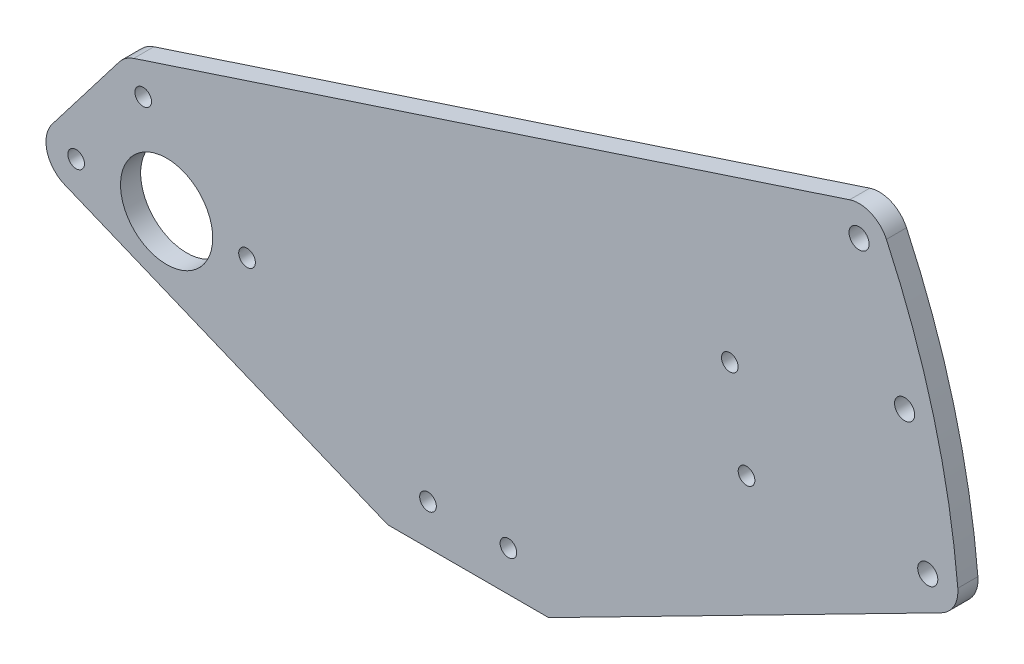
ISO-10303-21;
HEADER;
FILE_DESCRIPTION(('STEP AP214'),'2;1');
FILE_NAME('part.step','',(''),(''),'','','');
FILE_SCHEMA(('AUTOMOTIVE_DESIGN { 1 0 10303 214 1 1 1 1 }'));
ENDSEC;
DATA;
#1=APPLICATION_CONTEXT('core data for automotive mechanical design processes');
#2=APPLICATION_PROTOCOL_DEFINITION('international standard','automotive_design',2000,#1);
#3=PRODUCT_CONTEXT('',#1,'mechanical');
#4=PRODUCT('Part','Part','',(#3));
#5=PRODUCT_RELATED_PRODUCT_CATEGORY('part','',(#4));
#6=PRODUCT_DEFINITION_FORMATION('','',#4);
#7=PRODUCT_DEFINITION_CONTEXT('part definition',#1,'design');
#8=PRODUCT_DEFINITION('design','',#6,#7);
#9=PRODUCT_DEFINITION_SHAPE('','',#8);
#10=(LENGTH_UNIT() NAMED_UNIT(*) SI_UNIT(.MILLI.,.METRE.));
#11=(NAMED_UNIT(*) PLANE_ANGLE_UNIT() SI_UNIT($,.RADIAN.));
#12=(NAMED_UNIT(*) SI_UNIT($,.STERADIAN.) SOLID_ANGLE_UNIT());
#13=UNCERTAINTY_MEASURE_WITH_UNIT(LENGTH_MEASURE(1.E-05),#10,'distance_accuracy_value','');
#14=(GEOMETRIC_REPRESENTATION_CONTEXT(3) GLOBAL_UNCERTAINTY_ASSIGNED_CONTEXT((#13)) GLOBAL_UNIT_ASSIGNED_CONTEXT((#10,
#11,#12)) REPRESENTATION_CONTEXT('',''));
#15=CARTESIAN_POINT('',(0.,0.,0.));
#16=DIRECTION('',(0.,0.,1.));
#17=DIRECTION('',(1.,0.,0.));
#18=AXIS2_PLACEMENT_3D('',#15,#16,#17);
#19=CARTESIAN_POINT('',(-28.575,0.,6.35));
#20=DIRECTION('',(0.,0.,-1.));
#21=DIRECTION('',(-1.,0.,0.));
#22=AXIS2_PLACEMENT_3D('',#19,#20,#21);
#23=PLANE('',#22);
#24=CARTESIAN_POINT('',(-28.575,0.,6.35));
#25=DIRECTION('',(0.,0.,1.));
#26=DIRECTION('',(-1.,0.,0.));
#27=AXIS2_PLACEMENT_3D('',#24,#25,#26);
#28=CIRCLE('',#27,9.525);
#29=CARTESIAN_POINT('',(-36.131690566274,5.79845261130807,6.35));
#30=VERTEX_POINT('',#29);
#31=CARTESIAN_POINT('',(-32.1995145978968,-8.80843453342496,6.35));
#32=VERTEX_POINT('',#31);
#33=EDGE_CURVE('E182',#30,#32,#28,.T.);
#34=ORIENTED_EDGE('',*,*,#33,.T.);
#35=DIRECTION('',(0.924770029755901,-0.380526466970788,0.));
#36=VECTOR('',#35,1.);
#37=CARTESIAN_POINT('',(-32.1995145978968,-8.80843453342496,6.35));
#38=LINE('',#37,#36);
#39=CARTESIAN_POINT('',(69.85,-50.8,6.35));
#40=VERTEX_POINT('',#39);
#41=EDGE_CURVE('E106',#32,#40,#38,.T.);
#42=ORIENTED_EDGE('',*,*,#41,.T.);
#43=DIRECTION('',(1.,0.,0.));
#44=VECTOR('',#43,1.);
#45=CARTESIAN_POINT('',(69.85,-50.8,6.35));
#46=LINE('',#45,#44);
#47=CARTESIAN_POINT('',(120.65,-50.8,6.35));
#48=VERTEX_POINT('',#47);
#49=EDGE_CURVE('E211',#40,#48,#46,.T.);
#50=ORIENTED_EDGE('',*,*,#49,.T.);
#51=DIRECTION('',(0.890616679115882,0.454754803031918,0.));
#52=VECTOR('',#51,1.);
#53=CARTESIAN_POINT('',(120.65,-50.8,6.35));
#54=LINE('',#53,#52);
#55=CARTESIAN_POINT('',(244.713320148417,12.5475568564312,6.35));
#56=VERTEX_POINT('',#55);
#57=EDGE_CURVE('E231',#48,#56,#54,.T.);
#58=ORIENTED_EDGE('',*,*,#57,.T.);
#59=CARTESIAN_POINT('',(240.381780649538,21.03068072501,6.35));
#60=DIRECTION('',(0.,0.,1.));
#61=DIRECTION('',(-1.,0.,0.));
#62=AXIS2_PLACEMENT_3D('',#59,#60,#61);
#63=CIRCLE('',#62,9.52500000000004);
#64=CARTESIAN_POINT('',(249.870535148862,21.8608391746814,6.35));
#65=VERTEX_POINT('',#64);
#66=EDGE_CURVE('E227',#56,#65,#63,.T.);
#67=ORIENTED_EDGE('',*,*,#66,.T.);
#68=CARTESIAN_POINT('',(0.,0.,6.35));
#69=DIRECTION('',(0.,0.,1.));
#70=DIRECTION('',(-1.,0.,0.));
#71=AXIS2_PLACEMENT_3D('',#68,#69,#70);
#72=CIRCLE('',#71,250.825);
#73=CARTESIAN_POINT('',(227.324650683468,106.00322550111,6.35));
#74=VERTEX_POINT('',#73);
#75=EDGE_CURVE('E230',#65,#74,#72,.T.);
#76=ORIENTED_EDGE('',*,*,#75,.T.);
#77=CARTESIAN_POINT('',(218.692069011944,101.97778655803,6.35));
#78=DIRECTION('',(0.,0.,1.));
#79=DIRECTION('',(1.,0.,0.));
#80=AXIS2_PLACEMENT_3D('',#77,#78,#79);
#81=CIRCLE('',#80,9.52499999999996);
#82=CARTESIAN_POINT('',(215.715541799427,111.025764826856,6.35));
#83=VERTEX_POINT('',#82);
#84=EDGE_CURVE('E131',#74,#83,#81,.T.);
#85=ORIENTED_EDGE('',*,*,#84,.T.);
#86=DIRECTION('',(-0.949918978354434,-0.31249629527735,0.));
#87=VECTOR('',#86,1.);
#88=CARTESIAN_POINT('',(-10.3722814263212,36.6493087550361,6.35));
#89=LINE('',#88,#87);
#90=CARTESIAN_POINT('',(-10.3722814263212,36.6493087550361,6.35));
#91=VERTEX_POINT('',#90);
#92=EDGE_CURVE('E125',#83,#91,#89,.T.);
#93=ORIENTED_EDGE('',*,*,#92,.T.);
#94=CARTESIAN_POINT('',(-7.39575421380445,27.6013304862101,6.35));
#95=DIRECTION('',(0.,0.,1.));
#96=DIRECTION('',(1.,0.,0.));
#97=AXIS2_PLACEMENT_3D('',#94,#95,#96);
#98=CIRCLE('',#97,9.525);
#99=CARTESIAN_POINT('',(-14.9524447800785,33.3997830975182,6.35));
#100=VERTEX_POINT('',#99);
#101=EDGE_CURVE('E129',#91,#100,#98,.T.);
#102=ORIENTED_EDGE('',*,*,#101,.T.);
#103=DIRECTION('',(-0.608761429008722,-0.793353340291234,0.));
#104=VECTOR('',#103,1.);
#105=CARTESIAN_POINT('',(-36.131690566274,5.79845261130807,6.35));
#106=LINE('',#105,#104);
#107=EDGE_CURVE('E57',#100,#30,#106,.T.);
#108=ORIENTED_EDGE('',*,*,#107,.T.);
#109=EDGE_LOOP('',(#34,#42,#50,#58,#67,#76,#85,#93,#102,#108));
#110=FACE_BOUND('',#109,.T.);
#111=CARTESIAN_POINT('',(0.,0.,6.35));
#112=DIRECTION('',(0.,0.,1.));
#113=DIRECTION('',(1.,0.,0.));
#114=AXIS2_PLACEMENT_3D('',#111,#112,#113);
#115=CIRCLE('',#114,14.5542);
#116=CARTESIAN_POINT('',(14.5542,0.,6.35));
#117=VERTEX_POINT('',#116);
#118=EDGE_CURVE('E158',#117,#117,#115,.T.);
#119=ORIENTED_EDGE('',*,*,#118,.F.);
#120=EDGE_LOOP('',(#119));
#121=FACE_BOUND('',#120,.T.);
#122=CARTESIAN_POINT('',(-28.575,0.,6.35));
#123=DIRECTION('',(0.,0.,1.));
#124=DIRECTION('',(1.,0.,0.));
#125=AXIS2_PLACEMENT_3D('',#122,#123,#124);
#126=CIRCLE('',#125,2.6289);
#127=CARTESIAN_POINT('',(-25.9461,0.,6.35));
#128=VERTEX_POINT('',#127);
#129=EDGE_CURVE('E249',#128,#128,#126,.T.);
#130=ORIENTED_EDGE('',*,*,#129,.F.);
#131=EDGE_LOOP('',(#130));
#132=FACE_BOUND('',#131,.T.);
#133=CARTESIAN_POINT('',(-7.39575421380445,27.6013304862101,6.35));
#134=DIRECTION('',(0.,0.,1.));
#135=DIRECTION('',(1.,0.,0.));
#136=AXIS2_PLACEMENT_3D('',#133,#134,#135);
#137=CIRCLE('',#136,2.6289);
#138=CARTESIAN_POINT('',(-4.76685421380445,27.6013304862101,6.35));
#139=VERTEX_POINT('',#138);
#140=EDGE_CURVE('E257',#139,#139,#137,.T.);
#141=ORIENTED_EDGE('',*,*,#140,.F.);
#142=EDGE_LOOP('',(#141));
#143=FACE_BOUND('',#142,.T.);
#144=CARTESIAN_POINT('',(240.381780649538,21.03068072501,6.35));
#145=DIRECTION('',(0.,0.,1.));
#146=DIRECTION('',(1.,0.,0.));
#147=AXIS2_PLACEMENT_3D('',#144,#145,#146);
#148=CIRCLE('',#147,3.175);
#149=CARTESIAN_POINT('',(243.556780649538,21.03068072501,6.35));
#150=VERTEX_POINT('',#149);
#151=EDGE_CURVE('E265',#150,#150,#148,.T.);
#152=ORIENTED_EDGE('',*,*,#151,.F.);
#153=EDGE_LOOP('',(#152));
#154=FACE_BOUND('',#153,.T.);
#155=CARTESIAN_POINT('',(233.077901883552,62.4530355832381,6.35));
#156=DIRECTION('',(0.,0.,1.));
#157=DIRECTION('',(1.,0.,0.));
#158=AXIS2_PLACEMENT_3D('',#155,#156,#157);
#159=CIRCLE('',#158,3.17499999999997);
#160=CARTESIAN_POINT('',(236.252901883552,62.4530355832381,6.35));
#161=VERTEX_POINT('',#160);
#162=EDGE_CURVE('E273',#161,#161,#159,.T.);
#163=ORIENTED_EDGE('',*,*,#162,.F.);
#164=EDGE_LOOP('',(#163));
#165=FACE_BOUND('',#164,.T.);
#166=CARTESIAN_POINT('',(218.692069011944,101.97778655803,6.35));
#167=DIRECTION('',(0.,0.,1.));
#168=DIRECTION('',(1.,0.,0.));
#169=AXIS2_PLACEMENT_3D('',#166,#167,#168);
#170=CIRCLE('',#169,3.17499999999997);
#171=CARTESIAN_POINT('',(221.867069011944,101.97778655803,6.35));
#172=VERTEX_POINT('',#171);
#173=EDGE_CURVE('E281',#172,#172,#170,.T.);
#174=ORIENTED_EDGE('',*,*,#173,.F.);
#175=EDGE_LOOP('',(#174));
#176=FACE_BOUND('',#175,.T.);
#177=CARTESIAN_POINT('',(25.4,0.,6.35));
#178=DIRECTION('',(0.,0.,1.));
#179=DIRECTION('',(1.,0.,0.));
#180=AXIS2_PLACEMENT_3D('',#177,#178,#179);
#181=CIRCLE('',#180,2.6289);
#182=CARTESIAN_POINT('',(28.0289,0.,6.35));
#183=VERTEX_POINT('',#182);
#184=EDGE_CURVE('E289',#183,#183,#181,.T.);
#185=ORIENTED_EDGE('',*,*,#184,.F.);
#186=EDGE_LOOP('',(#185));
#187=FACE_BOUND('',#186,.T.);
#188=CARTESIAN_POINT('',(177.875240911132,47.6615271556294,6.35));
#189=DIRECTION('',(0.,0.,1.));
#190=DIRECTION('',(1.,0.,0.));
#191=AXIS2_PLACEMENT_3D('',#188,#189,#190);
#192=CIRCLE('',#191,2.62889999999999);
#193=CARTESIAN_POINT('',(180.504140911132,47.6615271556294,6.35));
#194=VERTEX_POINT('',#193);
#195=EDGE_CURVE('E297',#194,#194,#192,.T.);
#196=ORIENTED_EDGE('',*,*,#195,.F.);
#197=EDGE_LOOP('',(#196));
#198=FACE_BOUND('',#197,.T.);
#199=CARTESIAN_POINT('',(82.55,-38.1,6.35));
#200=DIRECTION('',(0.,0.,1.));
#201=DIRECTION('',(1.,0.,0.));
#202=AXIS2_PLACEMENT_3D('',#199,#200,#201);
#203=CIRCLE('',#202,2.62890000000001);
#204=CARTESIAN_POINT('',(85.1789,-38.1,6.35));
#205=VERTEX_POINT('',#204);
#206=EDGE_CURVE('E305',#205,#205,#203,.T.);
#207=ORIENTED_EDGE('',*,*,#206,.F.);
#208=EDGE_LOOP('',(#207));
#209=FACE_BOUND('',#208,.T.);
#210=CARTESIAN_POINT('',(107.95,-38.1,6.35));
#211=DIRECTION('',(0.,0.,1.));
#212=DIRECTION('',(1.,0.,0.));
#213=AXIS2_PLACEMENT_3D('',#210,#211,#212);
#214=CIRCLE('',#213,2.62890000000001);
#215=CARTESIAN_POINT('',(110.5789,-38.1,6.35));
#216=VERTEX_POINT('',#215);
#217=EDGE_CURVE('E313',#216,#216,#214,.T.);
#218=ORIENTED_EDGE('',*,*,#217,.F.);
#219=EDGE_LOOP('',(#218));
#220=FACE_BOUND('',#219,.T.);
#221=CARTESIAN_POINT('',(183.141207032067,19.2489165107385,6.35));
#222=DIRECTION('',(0.,0.,1.));
#223=DIRECTION('',(1.,0.,0.));
#224=AXIS2_PLACEMENT_3D('',#221,#222,#223);
#225=CIRCLE('',#224,2.62889999999999);
#226=CARTESIAN_POINT('',(185.770107032067,19.2489165107385,6.35));
#227=VERTEX_POINT('',#226);
#228=EDGE_CURVE('E321',#227,#227,#225,.T.);
#229=ORIENTED_EDGE('',*,*,#228,.F.);
#230=EDGE_LOOP('',(#229));
#231=FACE_BOUND('',#230,.T.);
#232=ADVANCED_FACE('F39',(#110,#121,#132,#143,#154,#165,#176,#187,#198,#209,#220,#231),#23,.F.);
#233=CARTESIAN_POINT('',(-28.575,0.,0.));
#234=DIRECTION('',(0.,0.,-1.));
#235=DIRECTION('',(-1.,0.,0.));
#236=AXIS2_PLACEMENT_3D('',#233,#234,#235);
#237=PLANE('',#236);
#238=CARTESIAN_POINT('',(107.95,-38.1,0.));
#239=DIRECTION('',(0.,0.,1.));
#240=DIRECTION('',(1.,0.,0.));
#241=AXIS2_PLACEMENT_3D('',#238,#239,#240);
#242=CIRCLE('',#241,2.62890000000001);
#243=CARTESIAN_POINT('',(110.5789,-38.1,0.));
#244=VERTEX_POINT('',#243);
#245=EDGE_CURVE('E317',#244,#244,#242,.T.);
#246=ORIENTED_EDGE('',*,*,#245,.T.);
#247=EDGE_LOOP('',(#246));
#248=FACE_BOUND('',#247,.T.);
#249=CARTESIAN_POINT('',(177.875240911132,47.6615271556294,0.));
#250=DIRECTION('',(0.,0.,1.));
#251=DIRECTION('',(1.,0.,0.));
#252=AXIS2_PLACEMENT_3D('',#249,#250,#251);
#253=CIRCLE('',#252,2.62889999999999);
#254=CARTESIAN_POINT('',(180.504140911132,47.6615271556294,0.));
#255=VERTEX_POINT('',#254);
#256=EDGE_CURVE('E301',#255,#255,#253,.T.);
#257=ORIENTED_EDGE('',*,*,#256,.T.);
#258=EDGE_LOOP('',(#257));
#259=FACE_BOUND('',#258,.T.);
#260=CARTESIAN_POINT('',(218.692069011944,101.97778655803,0.));
#261=DIRECTION('',(0.,0.,1.));
#262=DIRECTION('',(1.,0.,0.));
#263=AXIS2_PLACEMENT_3D('',#260,#261,#262);
#264=CIRCLE('',#263,3.17499999999997);
#265=CARTESIAN_POINT('',(221.867069011944,101.97778655803,0.));
#266=VERTEX_POINT('',#265);
#267=EDGE_CURVE('E285',#266,#266,#264,.T.);
#268=ORIENTED_EDGE('',*,*,#267,.T.);
#269=EDGE_LOOP('',(#268));
#270=FACE_BOUND('',#269,.T.);
#271=CARTESIAN_POINT('',(240.381780649538,21.03068072501,0.));
#272=DIRECTION('',(0.,0.,1.));
#273=DIRECTION('',(1.,0.,0.));
#274=AXIS2_PLACEMENT_3D('',#271,#272,#273);
#275=CIRCLE('',#274,3.175);
#276=CARTESIAN_POINT('',(243.556780649538,21.03068072501,0.));
#277=VERTEX_POINT('',#276);
#278=EDGE_CURVE('E269',#277,#277,#275,.T.);
#279=ORIENTED_EDGE('',*,*,#278,.T.);
#280=EDGE_LOOP('',(#279));
#281=FACE_BOUND('',#280,.T.);
#282=CARTESIAN_POINT('',(-28.575,0.,0.));
#283=DIRECTION('',(0.,0.,1.));
#284=DIRECTION('',(1.,0.,0.));
#285=AXIS2_PLACEMENT_3D('',#282,#283,#284);
#286=CIRCLE('',#285,2.6289);
#287=CARTESIAN_POINT('',(-25.9461,0.,0.));
#288=VERTEX_POINT('',#287);
#289=EDGE_CURVE('E253',#288,#288,#286,.T.);
#290=ORIENTED_EDGE('',*,*,#289,.T.);
#291=EDGE_LOOP('',(#290));
#292=FACE_BOUND('',#291,.T.);
#293=CARTESIAN_POINT('',(-28.575,0.,0.));
#294=DIRECTION('',(0.,0.,1.));
#295=DIRECTION('',(-1.,0.,0.));
#296=AXIS2_PLACEMENT_3D('',#293,#294,#295);
#297=CIRCLE('',#296,9.525);
#298=CARTESIAN_POINT('',(-36.131690566274,5.79845261130807,0.));
#299=VERTEX_POINT('',#298);
#300=CARTESIAN_POINT('',(-32.1995145978968,-8.80843453342496,0.));
#301=VERTEX_POINT('',#300);
#302=EDGE_CURVE('E153',#299,#301,#297,.T.);
#303=ORIENTED_EDGE('',*,*,#302,.F.);
#304=DIRECTION('',(-0.608761429008722,-0.793353340291234,0.));
#305=VECTOR('',#304,1.);
#306=CARTESIAN_POINT('',(-36.131690566274,5.79845261130807,0.));
#307=LINE('',#306,#305);
#308=CARTESIAN_POINT('',(-14.9524447800785,33.3997830975182,0.));
#309=VERTEX_POINT('',#308);
#310=EDGE_CURVE('E98',#309,#299,#307,.T.);
#311=ORIENTED_EDGE('',*,*,#310,.F.);
#312=CARTESIAN_POINT('',(-7.39575421380445,27.6013304862101,0.));
#313=DIRECTION('',(0.,0.,1.));
#314=DIRECTION('',(1.,0.,0.));
#315=AXIS2_PLACEMENT_3D('',#312,#313,#314);
#316=CIRCLE('',#315,9.525);
#317=CARTESIAN_POINT('',(-10.3722814263212,36.6493087550361,0.));
#318=VERTEX_POINT('',#317);
#319=EDGE_CURVE('E92',#318,#309,#316,.T.);
#320=ORIENTED_EDGE('',*,*,#319,.F.);
#321=DIRECTION('',(-0.949918978354434,-0.31249629527735,0.));
#322=VECTOR('',#321,1.);
#323=CARTESIAN_POINT('',(-10.3722814263212,36.6493087550361,0.));
#324=LINE('',#323,#322);
#325=CARTESIAN_POINT('',(215.715541799427,111.025764826856,0.));
#326=VERTEX_POINT('',#325);
#327=EDGE_CURVE('E140',#326,#318,#324,.T.);
#328=ORIENTED_EDGE('',*,*,#327,.F.);
#329=CARTESIAN_POINT('',(218.692069011944,101.97778655803,0.));
#330=DIRECTION('',(0.,0.,1.));
#331=DIRECTION('',(1.,0.,0.));
#332=AXIS2_PLACEMENT_3D('',#329,#330,#331);
#333=CIRCLE('',#332,9.52499999999996);
#334=CARTESIAN_POINT('',(227.324650683468,106.00322550111,0.));
#335=VERTEX_POINT('',#334);
#336=EDGE_CURVE('E173',#335,#326,#333,.T.);
#337=ORIENTED_EDGE('',*,*,#336,.F.);
#338=CARTESIAN_POINT('',(0.,0.,0.));
#339=DIRECTION('',(0.,0.,1.));
#340=DIRECTION('',(-1.,0.,0.));
#341=AXIS2_PLACEMENT_3D('',#338,#339,#340);
#342=CIRCLE('',#341,250.825);
#343=CARTESIAN_POINT('',(249.870535148862,21.8608391746814,0.));
#344=VERTEX_POINT('',#343);
#345=EDGE_CURVE('E170',#344,#335,#342,.T.);
#346=ORIENTED_EDGE('',*,*,#345,.F.);
#347=CARTESIAN_POINT('',(240.381780649538,21.03068072501,0.));
#348=DIRECTION('',(0.,0.,1.));
#349=DIRECTION('',(-1.,0.,0.));
#350=AXIS2_PLACEMENT_3D('',#347,#348,#349);
#351=CIRCLE('',#350,9.52500000000004);
#352=CARTESIAN_POINT('',(244.713320148417,12.5475568564312,0.));
#353=VERTEX_POINT('',#352);
#354=EDGE_CURVE('E167',#353,#344,#351,.T.);
#355=ORIENTED_EDGE('',*,*,#354,.F.);
#356=DIRECTION('',(0.890616679115882,0.454754803031918,0.));
#357=VECTOR('',#356,1.);
#358=CARTESIAN_POINT('',(120.65,-50.8,0.));
#359=LINE('',#358,#357);
#360=CARTESIAN_POINT('',(120.65,-50.8,0.));
#361=VERTEX_POINT('',#360);
#362=EDGE_CURVE('E164',#361,#353,#359,.T.);
#363=ORIENTED_EDGE('',*,*,#362,.F.);
#364=DIRECTION('',(1.,0.,0.));
#365=VECTOR('',#364,1.);
#366=CARTESIAN_POINT('',(69.85,-50.8,0.));
#367=LINE('',#366,#365);
#368=CARTESIAN_POINT('',(69.85,-50.8,0.));
#369=VERTEX_POINT('',#368);
#370=EDGE_CURVE('E161',#369,#361,#367,.T.);
#371=ORIENTED_EDGE('',*,*,#370,.F.);
#372=DIRECTION('',(0.924770029755901,-0.380526466970788,0.));
#373=VECTOR('',#372,1.);
#374=CARTESIAN_POINT('',(-32.1995145978968,-8.80843453342496,0.));
#375=LINE('',#374,#373);
#376=EDGE_CURVE('E157',#301,#369,#375,.T.);
#377=ORIENTED_EDGE('',*,*,#376,.F.);
#378=EDGE_LOOP('',(#303,#311,#320,#328,#337,#346,#355,#363,#371,#377));
#379=FACE_BOUND('',#378,.T.);
#380=CARTESIAN_POINT('',(0.,0.,0.));
#381=DIRECTION('',(0.,0.,1.));
#382=DIRECTION('',(1.,0.,0.));
#383=AXIS2_PLACEMENT_3D('',#380,#381,#382);
#384=CIRCLE('',#383,14.5542);
#385=CARTESIAN_POINT('',(14.5542,0.,0.));
#386=VERTEX_POINT('',#385);
#387=EDGE_CURVE('E245',#386,#386,#384,.T.);
#388=ORIENTED_EDGE('',*,*,#387,.T.);
#389=EDGE_LOOP('',(#388));
#390=FACE_BOUND('',#389,.T.);
#391=CARTESIAN_POINT('',(-7.39575421380445,27.6013304862101,0.));
#392=DIRECTION('',(0.,0.,1.));
#393=DIRECTION('',(1.,0.,0.));
#394=AXIS2_PLACEMENT_3D('',#391,#392,#393);
#395=CIRCLE('',#394,2.6289);
#396=CARTESIAN_POINT('',(-4.76685421380445,27.6013304862101,0.));
#397=VERTEX_POINT('',#396);
#398=EDGE_CURVE('E261',#397,#397,#395,.T.);
#399=ORIENTED_EDGE('',*,*,#398,.T.);
#400=EDGE_LOOP('',(#399));
#401=FACE_BOUND('',#400,.T.);
#402=CARTESIAN_POINT('',(233.077901883552,62.4530355832381,0.));
#403=DIRECTION('',(0.,0.,1.));
#404=DIRECTION('',(1.,0.,0.));
#405=AXIS2_PLACEMENT_3D('',#402,#403,#404);
#406=CIRCLE('',#405,3.17499999999997);
#407=CARTESIAN_POINT('',(236.252901883552,62.4530355832381,0.));
#408=VERTEX_POINT('',#407);
#409=EDGE_CURVE('E277',#408,#408,#406,.T.);
#410=ORIENTED_EDGE('',*,*,#409,.T.);
#411=EDGE_LOOP('',(#410));
#412=FACE_BOUND('',#411,.T.);
#413=CARTESIAN_POINT('',(25.4,0.,0.));
#414=DIRECTION('',(0.,0.,1.));
#415=DIRECTION('',(1.,0.,0.));
#416=AXIS2_PLACEMENT_3D('',#413,#414,#415);
#417=CIRCLE('',#416,2.6289);
#418=CARTESIAN_POINT('',(28.0289,0.,0.));
#419=VERTEX_POINT('',#418);
#420=EDGE_CURVE('E293',#419,#419,#417,.T.);
#421=ORIENTED_EDGE('',*,*,#420,.T.);
#422=EDGE_LOOP('',(#421));
#423=FACE_BOUND('',#422,.T.);
#424=CARTESIAN_POINT('',(82.55,-38.1,0.));
#425=DIRECTION('',(0.,0.,1.));
#426=DIRECTION('',(1.,0.,0.));
#427=AXIS2_PLACEMENT_3D('',#424,#425,#426);
#428=CIRCLE('',#427,2.62890000000001);
#429=CARTESIAN_POINT('',(85.1789,-38.1,0.));
#430=VERTEX_POINT('',#429);
#431=EDGE_CURVE('E309',#430,#430,#428,.T.);
#432=ORIENTED_EDGE('',*,*,#431,.T.);
#433=EDGE_LOOP('',(#432));
#434=FACE_BOUND('',#433,.T.);
#435=CARTESIAN_POINT('',(183.141207032067,19.2489165107385,0.));
#436=DIRECTION('',(0.,0.,1.));
#437=DIRECTION('',(1.,0.,0.));
#438=AXIS2_PLACEMENT_3D('',#435,#436,#437);
#439=CIRCLE('',#438,2.62889999999999);
#440=CARTESIAN_POINT('',(185.770107032067,19.2489165107385,0.));
#441=VERTEX_POINT('',#440);
#442=EDGE_CURVE('E325',#441,#441,#439,.T.);
#443=ORIENTED_EDGE('',*,*,#442,.T.);
#444=EDGE_LOOP('',(#443));
#445=FACE_BOUND('',#444,.T.);
#446=ADVANCED_FACE('F215',(#248,#259,#270,#281,#292,#379,#390,#401,#412,#423,#434,#445),#237,.T.);
#447=CARTESIAN_POINT('',(-28.575,0.,6.35));
#448=DIRECTION('',(0.,0.,-1.));
#449=DIRECTION('',(-1.,0.,0.));
#450=AXIS2_PLACEMENT_3D('',#447,#448,#449);
#451=CYLINDRICAL_SURFACE('',#450,9.525);
#452=ORIENTED_EDGE('',*,*,#302,.T.);
#453=DIRECTION('',(0.,0.,-1.));
#454=VECTOR('',#453,1.);
#455=CARTESIAN_POINT('',(-32.1995145978968,-8.80843453342496,6.35));
#456=LINE('',#455,#454);
#457=EDGE_CURVE('E11',#32,#301,#456,.T.);
#458=ORIENTED_EDGE('',*,*,#457,.F.);
#459=ORIENTED_EDGE('',*,*,#33,.F.);
#460=DIRECTION('',(0.,0.,-1.));
#461=VECTOR('',#460,1.);
#462=CARTESIAN_POINT('',(-36.131690566274,5.79845261130807,6.35));
#463=LINE('',#462,#461);
#464=EDGE_CURVE('E149',#30,#299,#463,.T.);
#465=ORIENTED_EDGE('',*,*,#464,.T.);
#466=EDGE_LOOP('',(#452,#458,#459,#465));
#467=FACE_BOUND('',#466,.T.);
#468=ADVANCED_FACE('F41',(#467),#451,.T.);
#469=CARTESIAN_POINT('',(-32.1995145978968,-8.80843453342496,6.35));
#470=DIRECTION('',(0.380526466970787,0.924770029755901,0.));
#471=DIRECTION('',(-0.924770029755901,0.380526466970788,0.));
#472=AXIS2_PLACEMENT_3D('',#469,#470,#471);
#473=PLANE('',#472);
#474=ORIENTED_EDGE('',*,*,#376,.T.);
#475=DIRECTION('',(0.,0.,-1.));
#476=VECTOR('',#475,1.);
#477=CARTESIAN_POINT('',(69.85,-50.8,6.35));
#478=LINE('',#477,#476);
#479=EDGE_CURVE('E49',#40,#369,#478,.T.);
#480=ORIENTED_EDGE('',*,*,#479,.F.);
#481=ORIENTED_EDGE('',*,*,#41,.F.);
#482=ORIENTED_EDGE('',*,*,#457,.T.);
#483=EDGE_LOOP('',(#474,#480,#481,#482));
#484=FACE_BOUND('',#483,.T.);
#485=ADVANCED_FACE('F367',(#484),#473,.F.);
#486=CARTESIAN_POINT('',(69.85,-50.8,6.35));
#487=DIRECTION('',(0.,1.,0.));
#488=DIRECTION('',(0.,0.,1.));
#489=AXIS2_PLACEMENT_3D('',#486,#487,#488);
#490=PLANE('',#489);
#491=ORIENTED_EDGE('',*,*,#370,.T.);
#492=DIRECTION('',(0.,0.,-1.));
#493=VECTOR('',#492,1.);
#494=CARTESIAN_POINT('',(120.65,-50.8,6.35));
#495=LINE('',#494,#493);
#496=EDGE_CURVE('E201',#48,#361,#495,.T.);
#497=ORIENTED_EDGE('',*,*,#496,.F.);
#498=ORIENTED_EDGE('',*,*,#49,.F.);
#499=ORIENTED_EDGE('',*,*,#479,.T.);
#500=EDGE_LOOP('',(#491,#497,#498,#499));
#501=FACE_BOUND('',#500,.T.);
#502=ADVANCED_FACE('F209',(#501),#490,.F.);
#503=CARTESIAN_POINT('',(120.65,-50.8,6.35));
#504=DIRECTION('',(-0.454754803031918,0.890616679115882,0.));
#505=DIRECTION('',(-0.890616679115882,-0.454754803031918,0.));
#506=AXIS2_PLACEMENT_3D('',#503,#504,#505);
#507=PLANE('',#506);
#508=ORIENTED_EDGE('',*,*,#362,.T.);
#509=DIRECTION('',(0.,0.,-1.));
#510=VECTOR('',#509,1.);
#511=CARTESIAN_POINT('',(244.713320148417,12.5475568564312,6.35));
#512=LINE('',#511,#510);
#513=EDGE_CURVE('E197',#56,#353,#512,.T.);
#514=ORIENTED_EDGE('',*,*,#513,.F.);
#515=ORIENTED_EDGE('',*,*,#57,.F.);
#516=ORIENTED_EDGE('',*,*,#496,.T.);
#517=EDGE_LOOP('',(#508,#514,#515,#516));
#518=FACE_BOUND('',#517,.T.);
#519=ADVANCED_FACE('F221',(#518),#507,.F.);
#520=CARTESIAN_POINT('',(240.381780649538,21.03068072501,6.35));
#521=DIRECTION('',(0.,0.,-1.));
#522=DIRECTION('',(-1.,0.,0.));
#523=AXIS2_PLACEMENT_3D('',#520,#521,#522);
#524=CYLINDRICAL_SURFACE('',#523,9.52500000000004);
#525=ORIENTED_EDGE('',*,*,#354,.T.);
#526=DIRECTION('',(0.,0.,-1.));
#527=VECTOR('',#526,1.);
#528=CARTESIAN_POINT('',(249.870535148862,21.8608391746814,6.35));
#529=LINE('',#528,#527);
#530=EDGE_CURVE('E193',#65,#344,#529,.T.);
#531=ORIENTED_EDGE('',*,*,#530,.F.);
#532=ORIENTED_EDGE('',*,*,#66,.F.);
#533=ORIENTED_EDGE('',*,*,#513,.T.);
#534=EDGE_LOOP('',(#525,#531,#532,#533));
#535=FACE_BOUND('',#534,.T.);
#536=ADVANCED_FACE('F225',(#535),#524,.T.);
#537=CARTESIAN_POINT('',(0.,0.,6.35));
#538=DIRECTION('',(0.,0.,-1.));
#539=DIRECTION('',(-1.,0.,0.));
#540=AXIS2_PLACEMENT_3D('',#537,#538,#539);
#541=CYLINDRICAL_SURFACE('',#540,250.825);
#542=ORIENTED_EDGE('',*,*,#345,.T.);
#543=DIRECTION('',(0.,0.,-1.));
#544=VECTOR('',#543,1.);
#545=CARTESIAN_POINT('',(227.324650683468,106.00322550111,6.35));
#546=LINE('',#545,#544);
#547=EDGE_CURVE('E189',#74,#335,#546,.T.);
#548=ORIENTED_EDGE('',*,*,#547,.F.);
#549=ORIENTED_EDGE('',*,*,#75,.F.);
#550=ORIENTED_EDGE('',*,*,#530,.T.);
#551=EDGE_LOOP('',(#542,#548,#549,#550));
#552=FACE_BOUND('',#551,.T.);
#553=ADVANCED_FACE('F357',(#552),#541,.T.);
#554=CARTESIAN_POINT('',(218.692069011944,101.97778655803,6.35));
#555=DIRECTION('',(0.,0.,-1.));
#556=DIRECTION('',(-1.,0.,0.));
#557=AXIS2_PLACEMENT_3D('',#554,#555,#556);
#558=CYLINDRICAL_SURFACE('',#557,9.52499999999996);
#559=ORIENTED_EDGE('',*,*,#336,.T.);
#560=DIRECTION('',(0.,0.,-1.));
#561=VECTOR('',#560,1.);
#562=CARTESIAN_POINT('',(215.715541799427,111.025764826856,6.35));
#563=LINE('',#562,#561);
#564=EDGE_CURVE('E142',#83,#326,#563,.T.);
#565=ORIENTED_EDGE('',*,*,#564,.F.);
#566=ORIENTED_EDGE('',*,*,#84,.F.);
#567=ORIENTED_EDGE('',*,*,#547,.T.);
#568=EDGE_LOOP('',(#559,#565,#566,#567));
#569=FACE_BOUND('',#568,.T.);
#570=ADVANCED_FACE('F354',(#569),#558,.T.);
#571=CARTESIAN_POINT('',(-10.3722814263212,36.6493087550361,6.35));
#572=DIRECTION('',(0.31249629527735,-0.949918978354434,0.));
#573=DIRECTION('',(0.949918978354434,0.31249629527735,0.));
#574=AXIS2_PLACEMENT_3D('',#571,#572,#573);
#575=PLANE('',#574);
#576=ORIENTED_EDGE('',*,*,#327,.T.);
#577=DIRECTION('',(0.,0.,-1.));
#578=VECTOR('',#577,1.);
#579=CARTESIAN_POINT('',(-10.3722814263212,36.6493087550361,6.35));
#580=LINE('',#579,#578);
#581=EDGE_CURVE('E137',#91,#318,#580,.T.);
#582=ORIENTED_EDGE('',*,*,#581,.F.);
#583=ORIENTED_EDGE('',*,*,#92,.F.);
#584=ORIENTED_EDGE('',*,*,#564,.T.);
#585=EDGE_LOOP('',(#576,#582,#583,#584));
#586=FACE_BOUND('',#585,.T.);
#587=ADVANCED_FACE('F138',(#586),#575,.F.);
#588=CARTESIAN_POINT('',(-7.39575421380445,27.6013304862101,6.35));
#589=DIRECTION('',(0.,0.,-1.));
#590=DIRECTION('',(-1.,0.,0.));
#591=AXIS2_PLACEMENT_3D('',#588,#589,#590);
#592=CYLINDRICAL_SURFACE('',#591,9.525);
#593=ORIENTED_EDGE('',*,*,#319,.T.);
#594=DIRECTION('',(0.,0.,-1.));
#595=VECTOR('',#594,1.);
#596=CARTESIAN_POINT('',(-14.9524447800785,33.3997830975182,6.35));
#597=LINE('',#596,#595);
#598=EDGE_CURVE('E143',#100,#309,#597,.T.);
#599=ORIENTED_EDGE('',*,*,#598,.F.);
#600=ORIENTED_EDGE('',*,*,#101,.F.);
#601=ORIENTED_EDGE('',*,*,#581,.T.);
#602=EDGE_LOOP('',(#593,#599,#600,#601));
#603=FACE_BOUND('',#602,.T.);
#604=ADVANCED_FACE('F145',(#603),#592,.T.);
#605=CARTESIAN_POINT('',(-36.131690566274,5.79845261130807,6.35));
#606=DIRECTION('',(0.793353340291234,-0.608761429008722,0.));
#607=DIRECTION('',(0.608761429008722,0.793353340291234,0.));
#608=AXIS2_PLACEMENT_3D('',#605,#606,#607);
#609=PLANE('',#608);
#610=ORIENTED_EDGE('',*,*,#310,.T.);
#611=ORIENTED_EDGE('',*,*,#464,.F.);
#612=ORIENTED_EDGE('',*,*,#107,.F.);
#613=ORIENTED_EDGE('',*,*,#598,.T.);
#614=EDGE_LOOP('',(#610,#611,#612,#613));
#615=FACE_BOUND('',#614,.T.);
#616=ADVANCED_FACE('F347',(#615),#609,.F.);
#617=CARTESIAN_POINT('',(0.,0.,6.35));
#618=DIRECTION('',(0.,0.,-1.));
#619=DIRECTION('',(-1.,0.,0.));
#620=AXIS2_PLACEMENT_3D('',#617,#618,#619);
#621=CYLINDRICAL_SURFACE('',#620,14.5542);
#622=ORIENTED_EDGE('',*,*,#118,.T.);
#623=EDGE_LOOP('',(#622));
#624=FACE_BOUND('',#623,.T.);
#625=ORIENTED_EDGE('',*,*,#387,.F.);
#626=EDGE_LOOP('',(#625));
#627=FACE_BOUND('',#626,.T.);
#628=ADVANCED_FACE('F344',(#624,#627),#621,.F.);
#629=CARTESIAN_POINT('',(-28.575,0.,6.35));
#630=DIRECTION('',(0.,0.,-1.));
#631=DIRECTION('',(-1.,0.,0.));
#632=AXIS2_PLACEMENT_3D('',#629,#630,#631);
#633=CYLINDRICAL_SURFACE('',#632,2.6289);
#634=ORIENTED_EDGE('',*,*,#129,.T.);
#635=EDGE_LOOP('',(#634));
#636=FACE_BOUND('',#635,.T.);
#637=ORIENTED_EDGE('',*,*,#289,.F.);
#638=EDGE_LOOP('',(#637));
#639=FACE_BOUND('',#638,.T.);
#640=ADVANCED_FACE('F443',(#636,#639),#633,.F.);
#641=CARTESIAN_POINT('',(-7.39575421380445,27.6013304862101,6.35));
#642=DIRECTION('',(0.,0.,-1.));
#643=DIRECTION('',(-1.,0.,0.));
#644=AXIS2_PLACEMENT_3D('',#641,#642,#643);
#645=CYLINDRICAL_SURFACE('',#644,2.6289);
#646=ORIENTED_EDGE('',*,*,#140,.T.);
#647=EDGE_LOOP('',(#646));
#648=FACE_BOUND('',#647,.T.);
#649=ORIENTED_EDGE('',*,*,#398,.F.);
#650=EDGE_LOOP('',(#649));
#651=FACE_BOUND('',#650,.T.);
#652=ADVANCED_FACE('F451',(#648,#651),#645,.F.);
#653=CARTESIAN_POINT('',(240.381780649538,21.03068072501,6.35));
#654=DIRECTION('',(0.,0.,-1.));
#655=DIRECTION('',(-1.,0.,0.));
#656=AXIS2_PLACEMENT_3D('',#653,#654,#655);
#657=CYLINDRICAL_SURFACE('',#656,3.175);
#658=ORIENTED_EDGE('',*,*,#151,.T.);
#659=EDGE_LOOP('',(#658));
#660=FACE_BOUND('',#659,.T.);
#661=ORIENTED_EDGE('',*,*,#278,.F.);
#662=EDGE_LOOP('',(#661));
#663=FACE_BOUND('',#662,.T.);
#664=ADVANCED_FACE('F459',(#660,#663),#657,.F.);
#665=CARTESIAN_POINT('',(233.077901883552,62.4530355832381,6.35));
#666=DIRECTION('',(0.,0.,-1.));
#667=DIRECTION('',(-1.,0.,0.));
#668=AXIS2_PLACEMENT_3D('',#665,#666,#667);
#669=CYLINDRICAL_SURFACE('',#668,3.17499999999997);
#670=ORIENTED_EDGE('',*,*,#162,.T.);
#671=EDGE_LOOP('',(#670));
#672=FACE_BOUND('',#671,.T.);
#673=ORIENTED_EDGE('',*,*,#409,.F.);
#674=EDGE_LOOP('',(#673));
#675=FACE_BOUND('',#674,.T.);
#676=ADVANCED_FACE('F468',(#672,#675),#669,.F.);
#677=CARTESIAN_POINT('',(218.692069011944,101.97778655803,6.35));
#678=DIRECTION('',(0.,0.,-1.));
#679=DIRECTION('',(-1.,0.,0.));
#680=AXIS2_PLACEMENT_3D('',#677,#678,#679);
#681=CYLINDRICAL_SURFACE('',#680,3.17499999999997);
#682=ORIENTED_EDGE('',*,*,#173,.T.);
#683=EDGE_LOOP('',(#682));
#684=FACE_BOUND('',#683,.T.);
#685=ORIENTED_EDGE('',*,*,#267,.F.);
#686=EDGE_LOOP('',(#685));
#687=FACE_BOUND('',#686,.T.);
#688=ADVANCED_FACE('F477',(#684,#687),#681,.F.);
#689=CARTESIAN_POINT('',(25.4,0.,6.35));
#690=DIRECTION('',(0.,0.,-1.));
#691=DIRECTION('',(-1.,0.,0.));
#692=AXIS2_PLACEMENT_3D('',#689,#690,#691);
#693=CYLINDRICAL_SURFACE('',#692,2.6289);
#694=ORIENTED_EDGE('',*,*,#184,.T.);
#695=EDGE_LOOP('',(#694));
#696=FACE_BOUND('',#695,.T.);
#697=ORIENTED_EDGE('',*,*,#420,.F.);
#698=EDGE_LOOP('',(#697));
#699=FACE_BOUND('',#698,.T.);
#700=ADVANCED_FACE('F486',(#696,#699),#693,.F.);
#701=CARTESIAN_POINT('',(177.875240911132,47.6615271556294,6.35));
#702=DIRECTION('',(0.,0.,-1.));
#703=DIRECTION('',(-1.,0.,0.));
#704=AXIS2_PLACEMENT_3D('',#701,#702,#703);
#705=CYLINDRICAL_SURFACE('',#704,2.62889999999999);
#706=ORIENTED_EDGE('',*,*,#195,.T.);
#707=EDGE_LOOP('',(#706));
#708=FACE_BOUND('',#707,.T.);
#709=ORIENTED_EDGE('',*,*,#256,.F.);
#710=EDGE_LOOP('',(#709));
#711=FACE_BOUND('',#710,.T.);
#712=ADVANCED_FACE('F495',(#708,#711),#705,.F.);
#713=CARTESIAN_POINT('',(82.55,-38.1,6.35));
#714=DIRECTION('',(0.,0.,-1.));
#715=DIRECTION('',(-1.,0.,0.));
#716=AXIS2_PLACEMENT_3D('',#713,#714,#715);
#717=CYLINDRICAL_SURFACE('',#716,2.62890000000001);
#718=ORIENTED_EDGE('',*,*,#206,.T.);
#719=EDGE_LOOP('',(#718));
#720=FACE_BOUND('',#719,.T.);
#721=ORIENTED_EDGE('',*,*,#431,.F.);
#722=EDGE_LOOP('',(#721));
#723=FACE_BOUND('',#722,.T.);
#724=ADVANCED_FACE('F504',(#720,#723),#717,.F.);
#725=CARTESIAN_POINT('',(107.95,-38.1,6.35));
#726=DIRECTION('',(0.,0.,-1.));
#727=DIRECTION('',(-1.,0.,0.));
#728=AXIS2_PLACEMENT_3D('',#725,#726,#727);
#729=CYLINDRICAL_SURFACE('',#728,2.62890000000001);
#730=ORIENTED_EDGE('',*,*,#217,.T.);
#731=EDGE_LOOP('',(#730));
#732=FACE_BOUND('',#731,.T.);
#733=ORIENTED_EDGE('',*,*,#245,.F.);
#734=EDGE_LOOP('',(#733));
#735=FACE_BOUND('',#734,.T.);
#736=ADVANCED_FACE('F513',(#732,#735),#729,.F.);
#737=CARTESIAN_POINT('',(183.141207032067,19.2489165107385,6.35));
#738=DIRECTION('',(0.,0.,-1.));
#739=DIRECTION('',(-1.,0.,0.));
#740=AXIS2_PLACEMENT_3D('',#737,#738,#739);
#741=CYLINDRICAL_SURFACE('',#740,2.62889999999999);
#742=ORIENTED_EDGE('',*,*,#228,.T.);
#743=EDGE_LOOP('',(#742));
#744=FACE_BOUND('',#743,.T.);
#745=ORIENTED_EDGE('',*,*,#442,.F.);
#746=EDGE_LOOP('',(#745));
#747=FACE_BOUND('',#746,.T.);
#748=ADVANCED_FACE('F333',(#744,#747),#741,.F.);
#749=CLOSED_SHELL('',(#232,#446,#468,#485,#502,#519,#536,#553,#570,#587,#604,#616,#628,#640,
#652,#664,#676,#688,#700,#712,#724,#736,#748));
#750=MANIFOLD_SOLID_BREP('B2',#749);
#751=ADVANCED_BREP_SHAPE_REPRESENTATION('',(#18,#750),#14);
#752=SHAPE_DEFINITION_REPRESENTATION(#9,#751);
ENDSEC;
END-ISO-10303-21;
